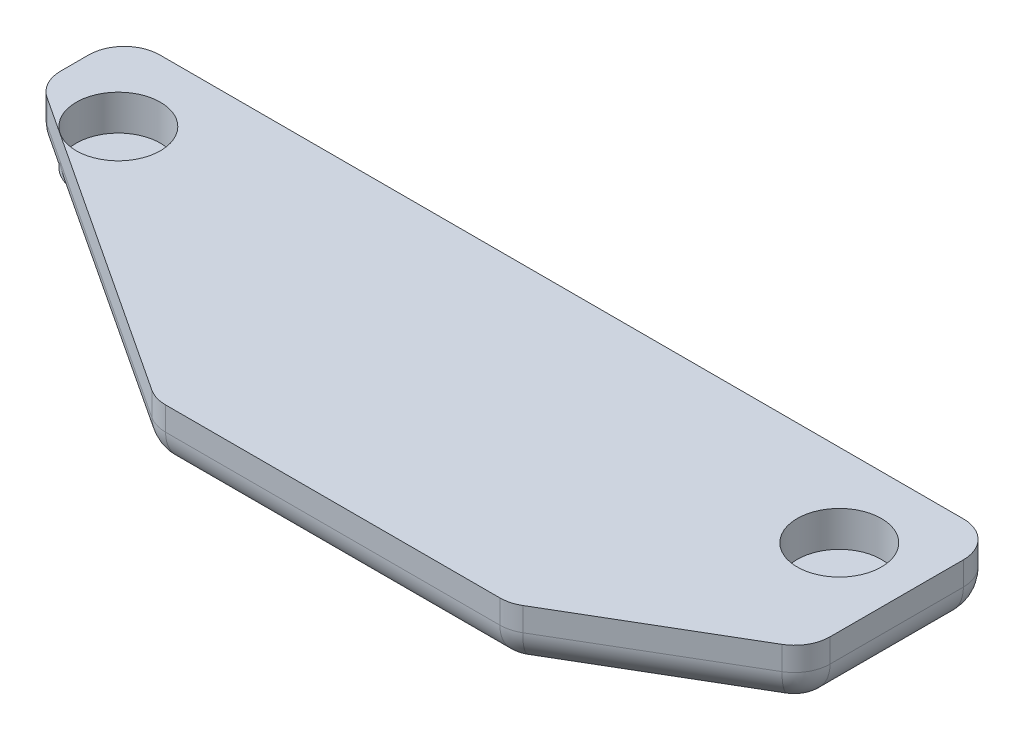
ISO-10303-21;
HEADER;
FILE_DESCRIPTION(('STEP AP214'),'2;1');
FILE_NAME('part.step','',(''),(''),'','','');
FILE_SCHEMA(('AUTOMOTIVE_DESIGN { 1 0 10303 214 1 1 1 1 }'));
ENDSEC;
DATA;
#1=APPLICATION_CONTEXT('core data for automotive mechanical design processes');
#2=APPLICATION_PROTOCOL_DEFINITION('international standard','automotive_design',2000,#1);
#3=PRODUCT_CONTEXT('',#1,'mechanical');
#4=PRODUCT('Part','Part','',(#3));
#5=PRODUCT_RELATED_PRODUCT_CATEGORY('part','',(#4));
#6=PRODUCT_DEFINITION_FORMATION('','',#4);
#7=PRODUCT_DEFINITION_CONTEXT('part definition',#1,'design');
#8=PRODUCT_DEFINITION('design','',#6,#7);
#9=PRODUCT_DEFINITION_SHAPE('','',#8);
#10=(LENGTH_UNIT() NAMED_UNIT(*) SI_UNIT(.MILLI.,.METRE.));
#11=(NAMED_UNIT(*) PLANE_ANGLE_UNIT() SI_UNIT($,.RADIAN.));
#12=(NAMED_UNIT(*) SI_UNIT($,.STERADIAN.) SOLID_ANGLE_UNIT());
#13=UNCERTAINTY_MEASURE_WITH_UNIT(LENGTH_MEASURE(1.E-05),#10,'distance_accuracy_value','');
#14=(GEOMETRIC_REPRESENTATION_CONTEXT(3) GLOBAL_UNCERTAINTY_ASSIGNED_CONTEXT((#13)) GLOBAL_UNIT_ASSIGNED_CONTEXT((#10,
#11,#12)) REPRESENTATION_CONTEXT('',''));
#15=CARTESIAN_POINT('',(0.,0.,0.));
#16=DIRECTION('',(0.,0.,1.));
#17=DIRECTION('',(1.,0.,0.));
#18=AXIS2_PLACEMENT_3D('',#15,#16,#17);
#19=CARTESIAN_POINT('',(-21.2161538362544,2.5,-11.7419034293701));
#20=DIRECTION('',(0.,0.,1.));
#21=DIRECTION('',(1.,0.,0.));
#22=AXIS2_PLACEMENT_3D('',#19,#20,#21);
#23=PLANE('',#22);
#24=DIRECTION('',(-1.,0.,0.));
#25=VECTOR('',#24,1.);
#26=CARTESIAN_POINT('',(-21.2161538362544,2.5,-11.7419034293701));
#27=LINE('',#26,#25);
#28=CARTESIAN_POINT('',(14.2838461637456,2.5,-11.7419034293701));
#29=VERTEX_POINT('',#28);
#30=CARTESIAN_POINT('',(-19.7161538362544,2.5,-11.7419034293701));
#31=VERTEX_POINT('',#30);
#32=EDGE_CURVE('E342',#29,#31,#27,.T.);
#33=ORIENTED_EDGE('',*,*,#32,.F.);
#34=DIRECTION('',(0.,-1.,0.));
#35=VECTOR('',#34,1.);
#36=CARTESIAN_POINT('',(14.2838461637456,2.5,-11.7419034293701));
#37=LINE('',#36,#35);
#38=CARTESIAN_POINT('',(14.2838461637456,1.5,-11.7419034293701));
#39=VERTEX_POINT('',#38);
#40=EDGE_CURVE('E11',#29,#39,#37,.T.);
#41=ORIENTED_EDGE('',*,*,#40,.T.);
#42=DIRECTION('',(-1.,0.,0.));
#43=VECTOR('',#42,1.);
#44=CARTESIAN_POINT('',(-21.2161538362544,1.5,-11.7419034293701));
#45=LINE('',#44,#43);
#46=CARTESIAN_POINT('',(-19.7161538362544,1.5,-11.7419034293701));
#47=VERTEX_POINT('',#46);
#48=EDGE_CURVE('E55',#39,#47,#45,.T.);
#49=ORIENTED_EDGE('',*,*,#48,.T.);
#50=DIRECTION('',(0.,-1.,0.));
#51=VECTOR('',#50,1.);
#52=CARTESIAN_POINT('',(-19.7161538362544,2.5,-11.7419034293701));
#53=LINE('',#52,#51);
#54=EDGE_CURVE('E254',#47,#31,#53,.F.);
#55=ORIENTED_EDGE('',*,*,#54,.T.);
#56=EDGE_LOOP('',(#33,#41,#49,#55));
#57=FACE_BOUND('',#56,.T.);
#58=ADVANCED_FACE('F45',(#57),#23,.F.);
#59=CARTESIAN_POINT('',(-21.2161538362544,2.5,-11.7419034293701));
#60=DIRECTION('',(1.,0.,0.));
#61=DIRECTION('',(0.,0.,-1.));
#62=AXIS2_PLACEMENT_3D('',#59,#60,#61);
#63=PLANE('',#62);
#64=DIRECTION('',(0.,0.,1.));
#65=VECTOR('',#64,1.);
#66=CARTESIAN_POINT('',(-21.2161538362544,1.5,-11.7419034293701));
#67=LINE('',#66,#65);
#68=CARTESIAN_POINT('',(-21.2161538362544,1.5,-10.2419034293701));
#69=VERTEX_POINT('',#68);
#70=CARTESIAN_POINT('',(-21.2161538362544,1.5,-9.05107985148774));
#71=VERTEX_POINT('',#70);
#72=EDGE_CURVE('E220',#69,#71,#67,.T.);
#73=ORIENTED_EDGE('',*,*,#72,.T.);
#74=DIRECTION('',(0.,-1.,0.));
#75=VECTOR('',#74,1.);
#76=CARTESIAN_POINT('',(-21.2161538362544,2.5,-9.05107985148774));
#77=LINE('',#76,#75);
#78=CARTESIAN_POINT('',(-21.2161538362544,2.5,-9.05107985148774));
#79=VERTEX_POINT('',#78);
#80=EDGE_CURVE('E223',#71,#79,#77,.F.);
#81=ORIENTED_EDGE('',*,*,#80,.T.);
#82=DIRECTION('',(0.,0.,1.));
#83=VECTOR('',#82,1.);
#84=CARTESIAN_POINT('',(-21.2161538362544,2.5,-11.7419034293701));
#85=LINE('',#84,#83);
#86=CARTESIAN_POINT('',(-21.2161538362544,2.5,-10.2419034293701));
#87=VERTEX_POINT('',#86);
#88=EDGE_CURVE('E346',#87,#79,#85,.T.);
#89=ORIENTED_EDGE('',*,*,#88,.F.);
#90=DIRECTION('',(0.,-1.,0.));
#91=VECTOR('',#90,1.);
#92=CARTESIAN_POINT('',(-21.2161538362544,2.5,-10.2419034293701));
#93=LINE('',#92,#91);
#94=EDGE_CURVE('E217',#87,#69,#93,.T.);
#95=ORIENTED_EDGE('',*,*,#94,.T.);
#96=EDGE_LOOP('',(#73,#81,#89,#95));
#97=FACE_BOUND('',#96,.T.);
#98=ADVANCED_FACE('F390',(#97),#63,.F.);
#99=CARTESIAN_POINT('',(-21.2161538362544,2.5,-8.24190342937014));
#100=DIRECTION('',(0.549177886660837,0.,-0.835705479701274));
#101=DIRECTION('',(-0.835705479701274,0.,-0.549177886660837));
#102=AXIS2_PLACEMENT_3D('',#99,#100,#101);
#103=PLANE('',#102);
#104=DIRECTION('',(0.835705479701274,0.,0.549177886660837));
#105=VECTOR('',#104,1.);
#106=CARTESIAN_POINT('',(-21.2161538362544,1.5,-8.24190342937014));
#107=LINE('',#106,#105);
#108=CARTESIAN_POINT('',(-20.5399206662457,1.5,-7.79752163193583));
#109=VERTEX_POINT('',#108);
#110=CARTESIAN_POINT('',(-7.59117393693629,1.5,0.711654790181765));
#111=VERTEX_POINT('',#110);
#112=EDGE_CURVE('E211',#109,#111,#107,.T.);
#113=ORIENTED_EDGE('',*,*,#112,.T.);
#114=DIRECTION('',(0.,-1.,0.));
#115=VECTOR('',#114,1.);
#116=CARTESIAN_POINT('',(-7.59117393693629,2.5,0.711654790181766));
#117=LINE('',#116,#115);
#118=CARTESIAN_POINT('',(-7.59117393693629,2.5,0.711654790181766));
#119=VERTEX_POINT('',#118);
#120=EDGE_CURVE('E214',#111,#119,#117,.F.);
#121=ORIENTED_EDGE('',*,*,#120,.T.);
#122=DIRECTION('',(0.835705479701274,0.,0.549177886660837));
#123=VECTOR('',#122,1.);
#124=CARTESIAN_POINT('',(-21.2161538362544,2.5,-8.24190342937014));
#125=LINE('',#124,#123);
#126=CARTESIAN_POINT('',(-20.5399206662457,2.5,-7.79752163193583));
#127=VERTEX_POINT('',#126);
#128=EDGE_CURVE('E351',#127,#119,#125,.T.);
#129=ORIENTED_EDGE('',*,*,#128,.F.);
#130=DIRECTION('',(0.,-1.,0.));
#131=VECTOR('',#130,1.);
#132=CARTESIAN_POINT('',(-20.5399206662457,2.5,-7.79752163193583));
#133=LINE('',#132,#131);
#134=EDGE_CURVE('E163',#127,#109,#133,.T.);
#135=ORIENTED_EDGE('',*,*,#134,.T.);
#136=EDGE_LOOP('',(#113,#121,#129,#135));
#137=FACE_BOUND('',#136,.T.);
#138=ADVANCED_FACE('F395',(#137),#103,.F.);
#139=CARTESIAN_POINT('',(-7.21615383625442,2.5,0.958096570629853));
#140=DIRECTION('',(0.,0.,-1.));
#141=DIRECTION('',(-1.,0.,0.));
#142=AXIS2_PLACEMENT_3D('',#139,#140,#141);
#143=PLANE('',#142);
#144=DIRECTION('',(1.,0.,0.));
#145=VECTOR('',#144,1.);
#146=CARTESIAN_POINT('',(-7.21615383625442,1.5,0.958096570629853));
#147=LINE('',#146,#145);
#148=CARTESIAN_POINT('',(-6.76740710694503,1.5,0.958096570629853));
#149=VERTEX_POINT('',#148);
#150=CARTESIAN_POINT('',(7.37582391861444,1.5,0.958096570629853));
#151=VERTEX_POINT('',#150);
#152=EDGE_CURVE('E180',#149,#151,#147,.T.);
#153=ORIENTED_EDGE('',*,*,#152,.T.);
#154=DIRECTION('',(0.,-1.,0.));
#155=VECTOR('',#154,1.);
#156=CARTESIAN_POINT('',(7.37582391861444,2.5,0.958096570629853));
#157=LINE('',#156,#155);
#158=CARTESIAN_POINT('',(7.37582391861444,2.5,0.958096570629853));
#159=VERTEX_POINT('',#158);
#160=EDGE_CURVE('E192',#151,#159,#157,.F.);
#161=ORIENTED_EDGE('',*,*,#160,.T.);
#162=DIRECTION('',(1.,0.,0.));
#163=VECTOR('',#162,1.);
#164=CARTESIAN_POINT('',(-7.21615383625442,2.5,0.958096570629853));
#165=LINE('',#164,#163);
#166=CARTESIAN_POINT('',(-6.76740710694503,2.5,0.958096570629853));
#167=VERTEX_POINT('',#166);
#168=EDGE_CURVE('E158',#167,#159,#165,.T.);
#169=ORIENTED_EDGE('',*,*,#168,.F.);
#170=DIRECTION('',(0.,-1.,0.));
#171=VECTOR('',#170,1.);
#172=CARTESIAN_POINT('',(-6.76740710694503,2.5,0.958096570629853));
#173=LINE('',#172,#171);
#174=EDGE_CURVE('E185',#167,#149,#173,.T.);
#175=ORIENTED_EDGE('',*,*,#174,.T.);
#176=EDGE_LOOP('',(#153,#161,#169,#175));
#177=FACE_BOUND('',#176,.T.);
#178=ADVANCED_FACE('F491',(#177),#143,.F.);
#179=CARTESIAN_POINT('',(7.78384616374558,2.5,0.958096570629853));
#180=DIRECTION('',(-0.506549048630866,0.,-0.862211146605729));
#181=DIRECTION('',(-0.862211146605729,0.,0.506549048630866));
#182=AXIS2_PLACEMENT_3D('',#179,#180,#181);
#183=PLANE('',#182);
#184=DIRECTION('',(0.862211146605729,0.,-0.506549048630866));
#185=VECTOR('',#184,1.);
#186=CARTESIAN_POINT('',(7.78384616374558,2.5,0.958096570629853));
#187=LINE('',#186,#185);
#188=CARTESIAN_POINT('',(8.13564749156074,2.5,0.751413290538446));
#189=VERTEX_POINT('',#188);
#190=CARTESIAN_POINT('',(15.0436697366919,2.5,-3.3070497784761));
#191=VERTEX_POINT('',#190);
#192=EDGE_CURVE('E155',#189,#191,#187,.T.);
#193=ORIENTED_EDGE('',*,*,#192,.F.);
#194=DIRECTION('',(0.,-1.,0.));
#195=VECTOR('',#194,1.);
#196=CARTESIAN_POINT('',(8.13564749156074,2.5,0.751413290538446));
#197=LINE('',#196,#195);
#198=CARTESIAN_POINT('',(8.13564749156074,1.5,0.751413290538446));
#199=VERTEX_POINT('',#198);
#200=EDGE_CURVE('E169',#189,#199,#197,.T.);
#201=ORIENTED_EDGE('',*,*,#200,.T.);
#202=DIRECTION('',(0.862211146605729,0.,-0.506549048630866));
#203=VECTOR('',#202,1.);
#204=CARTESIAN_POINT('',(7.78384616374558,1.5,0.958096570629853));
#205=LINE('',#204,#203);
#206=CARTESIAN_POINT('',(15.0436697366919,1.5,-3.3070497784761));
#207=VERTEX_POINT('',#206);
#208=EDGE_CURVE('E181',#199,#207,#205,.T.);
#209=ORIENTED_EDGE('',*,*,#208,.T.);
#210=DIRECTION('',(0.,-1.,0.));
#211=VECTOR('',#210,1.);
#212=CARTESIAN_POINT('',(15.0436697366919,2.5,-3.3070497784761));
#213=LINE('',#212,#211);
#214=EDGE_CURVE('E171',#207,#191,#213,.F.);
#215=ORIENTED_EDGE('',*,*,#214,.T.);
#216=EDGE_LOOP('',(#193,#201,#209,#215));
#217=FACE_BOUND('',#216,.T.);
#218=ADVANCED_FACE('F168',(#217),#183,.F.);
#219=CARTESIAN_POINT('',(15.7838461637456,2.5,-3.74190342937014));
#220=DIRECTION('',(-1.,0.,0.));
#221=DIRECTION('',(0.,0.,1.));
#222=AXIS2_PLACEMENT_3D('',#219,#220,#221);
#223=PLANE('',#222);
#224=DIRECTION('',(0.,0.,-1.));
#225=VECTOR('',#224,1.);
#226=CARTESIAN_POINT('',(15.7838461637456,2.5,-3.74190342937014));
#227=LINE('',#226,#225);
#228=CARTESIAN_POINT('',(15.7838461637456,2.5,-4.60036649838469));
#229=VERTEX_POINT('',#228);
#230=CARTESIAN_POINT('',(15.7838461637456,2.5,-10.2419034293701));
#231=VERTEX_POINT('',#230);
#232=EDGE_CURVE('E173',#229,#231,#227,.T.);
#233=ORIENTED_EDGE('',*,*,#232,.F.);
#234=DIRECTION('',(0.,-1.,0.));
#235=VECTOR('',#234,1.);
#236=CARTESIAN_POINT('',(15.7838461637456,2.5,-4.60036649838469));
#237=LINE('',#236,#235);
#238=CARTESIAN_POINT('',(15.7838461637456,1.5,-4.60036649838469));
#239=VERTEX_POINT('',#238);
#240=EDGE_CURVE('E251',#229,#239,#237,.T.);
#241=ORIENTED_EDGE('',*,*,#240,.T.);
#242=DIRECTION('',(0.,0.,-1.));
#243=VECTOR('',#242,1.);
#244=CARTESIAN_POINT('',(15.7838461637456,1.5,-3.74190342937014));
#245=LINE('',#244,#243);
#246=CARTESIAN_POINT('',(15.7838461637456,1.5,-10.2419034293701));
#247=VERTEX_POINT('',#246);
#248=EDGE_CURVE('E248',#239,#247,#245,.T.);
#249=ORIENTED_EDGE('',*,*,#248,.T.);
#250=DIRECTION('',(0.,-1.,0.));
#251=VECTOR('',#250,1.);
#252=CARTESIAN_POINT('',(15.7838461637456,2.5,-10.2419034293701));
#253=LINE('',#252,#251);
#254=EDGE_CURVE('E245',#247,#231,#253,.F.);
#255=ORIENTED_EDGE('',*,*,#254,.T.);
#256=EDGE_LOOP('',(#233,#241,#249,#255));
#257=FACE_BOUND('',#256,.T.);
#258=ADVANCED_FACE('F372',(#257),#223,.F.);
#259=CARTESIAN_POINT('',(0.,2.5,0.));
#260=DIRECTION('',(0.,1.,0.));
#261=DIRECTION('',(0.,0.,1.));
#262=AXIS2_PLACEMENT_3D('',#259,#260,#261);
#263=PLANE('',#262);
#264=CARTESIAN_POINT('',(-17.9661538362544,2.5,-8.24190342937014));
#265=DIRECTION('',(0.,1.,0.));
#266=DIRECTION('',(0.,0.,1.));
#267=AXIS2_PLACEMENT_3D('',#264,#265,#266);
#268=CIRCLE('',#267,1.78);
#269=CARTESIAN_POINT('',(-17.9661538362544,2.5,-6.46190342937014));
#270=VERTEX_POINT('',#269);
#271=EDGE_CURVE('E338',#270,#270,#268,.T.);
#272=ORIENTED_EDGE('',*,*,#271,.F.);
#273=EDGE_LOOP('',(#272));
#274=FACE_BOUND('',#273,.T.);
#275=CARTESIAN_POINT('',(12.5338461637456,2.5,-8.24190342937015));
#276=DIRECTION('',(0.,1.,0.));
#277=DIRECTION('',(0.,0.,-1.));
#278=AXIS2_PLACEMENT_3D('',#275,#276,#277);
#279=CIRCLE('',#278,1.78);
#280=CARTESIAN_POINT('',(12.5338461637456,2.5,-10.0219034293702));
#281=VERTEX_POINT('',#280);
#282=EDGE_CURVE('E332',#281,#281,#279,.T.);
#283=ORIENTED_EDGE('',*,*,#282,.F.);
#284=EDGE_LOOP('',(#283));
#285=FACE_BOUND('',#284,.T.);
#286=ORIENTED_EDGE('',*,*,#168,.T.);
#287=CARTESIAN_POINT('',(7.37582391861444,2.5,-0.541903429370147));
#288=DIRECTION('',(0.,1.,0.));
#289=DIRECTION('',(0.,0.,1.));
#290=AXIS2_PLACEMENT_3D('',#287,#288,#289);
#291=CIRCLE('',#290,1.5);
#292=EDGE_CURVE('E152',#159,#189,#291,.T.);
#293=ORIENTED_EDGE('',*,*,#292,.T.);
#294=ORIENTED_EDGE('',*,*,#192,.T.);
#295=CARTESIAN_POINT('',(14.2838461637456,2.5,-4.60036649838469));
#296=DIRECTION('',(0.,1.,0.));
#297=DIRECTION('',(0.,0.,1.));
#298=AXIS2_PLACEMENT_3D('',#295,#296,#297);
#299=CIRCLE('',#298,1.5);
#300=EDGE_CURVE('E204',#191,#229,#299,.T.);
#301=ORIENTED_EDGE('',*,*,#300,.T.);
#302=ORIENTED_EDGE('',*,*,#232,.T.);
#303=CARTESIAN_POINT('',(14.2838461637456,2.5,-10.2419034293701));
#304=DIRECTION('',(0.,1.,0.));
#305=DIRECTION('',(0.,0.,1.));
#306=AXIS2_PLACEMENT_3D('',#303,#304,#305);
#307=CIRCLE('',#306,1.5);
#308=EDGE_CURVE('E201',#231,#29,#307,.T.);
#309=ORIENTED_EDGE('',*,*,#308,.T.);
#310=ORIENTED_EDGE('',*,*,#32,.T.);
#311=CARTESIAN_POINT('',(-19.7161538362544,2.5,-10.2419034293701));
#312=DIRECTION('',(0.,1.,0.));
#313=DIRECTION('',(0.,0.,1.));
#314=AXIS2_PLACEMENT_3D('',#311,#312,#313);
#315=CIRCLE('',#314,1.5);
#316=EDGE_CURVE('E195',#31,#87,#315,.T.);
#317=ORIENTED_EDGE('',*,*,#316,.T.);
#318=ORIENTED_EDGE('',*,*,#88,.T.);
#319=CARTESIAN_POINT('',(-19.7161538362544,2.5,-9.05107985148774));
#320=DIRECTION('',(0.,1.,0.));
#321=DIRECTION('',(0.,0.,1.));
#322=AXIS2_PLACEMENT_3D('',#319,#320,#321);
#323=CIRCLE('',#322,1.5);
#324=EDGE_CURVE('E198',#79,#127,#323,.T.);
#325=ORIENTED_EDGE('',*,*,#324,.T.);
#326=ORIENTED_EDGE('',*,*,#128,.T.);
#327=CARTESIAN_POINT('',(-6.76740710694503,2.5,-0.541903429370147));
#328=DIRECTION('',(0.,1.,0.));
#329=DIRECTION('',(0.,0.,1.));
#330=AXIS2_PLACEMENT_3D('',#327,#328,#329);
#331=CIRCLE('',#330,1.5);
#332=EDGE_CURVE('E164',#119,#167,#331,.T.);
#333=ORIENTED_EDGE('',*,*,#332,.T.);
#334=EDGE_LOOP('',(#286,#293,#294,#301,#302,#309,#310,#317,#318,#325,#326,#333));
#335=FACE_BOUND('',#334,.T.);
#336=ADVANCED_FACE('F154',(#274,#285,#335),#263,.T.);
#337=CARTESIAN_POINT('',(0.,0.,0.));
#338=DIRECTION('',(0.,1.,0.));
#339=DIRECTION('',(0.,0.,1.));
#340=AXIS2_PLACEMENT_3D('',#337,#338,#339);
#341=PLANE('',#340);
#342=DIRECTION('',(0.835705479701274,0.,0.549177886660837));
#343=VECTOR('',#342,1.);
#344=CARTESIAN_POINT('',(-1.79231818639165,0.,2.72744071842208));
#345=LINE('',#344,#343);
#346=CARTESIAN_POINT('',(-6.76740710694504,0.,-0.541903429370147));
#347=VERTEX_POINT('',#346);
#348=CARTESIAN_POINT('',(-19.7161538362544,0.,-9.05107985148774));
#349=VERTEX_POINT('',#348);
#350=EDGE_CURVE('E238',#347,#349,#345,.F.);
#351=ORIENTED_EDGE('',*,*,#350,.T.);
#352=DIRECTION('',(0.,0.,1.));
#353=VECTOR('',#352,1.);
#354=CARTESIAN_POINT('',(-19.7161538362544,0.,0.));
#355=LINE('',#354,#353);
#356=CARTESIAN_POINT('',(-19.7161538362544,0.,-10.2419034293701));
#357=VERTEX_POINT('',#356);
#358=EDGE_CURVE('E241',#349,#357,#355,.F.);
#359=ORIENTED_EDGE('',*,*,#358,.T.);
#360=DIRECTION('',(-1.,0.,0.));
#361=VECTOR('',#360,1.);
#362=CARTESIAN_POINT('',(0.,0.,-10.2419034293701));
#363=LINE('',#362,#361);
#364=CARTESIAN_POINT('',(14.2838461637456,0.,-10.2419034293701));
#365=VERTEX_POINT('',#364);
#366=EDGE_CURVE('E226',#357,#365,#363,.F.);
#367=ORIENTED_EDGE('',*,*,#366,.T.);
#368=DIRECTION('',(0.,0.,-1.));
#369=VECTOR('',#368,1.);
#370=CARTESIAN_POINT('',(14.2838461637456,0.,0.));
#371=LINE('',#370,#369);
#372=CARTESIAN_POINT('',(14.2838461637456,0.,-4.60036649838469));
#373=VERTEX_POINT('',#372);
#374=EDGE_CURVE('E229',#365,#373,#371,.F.);
#375=ORIENTED_EDGE('',*,*,#374,.T.);
#376=DIRECTION('',(0.862211146605729,0.,-0.506549048630866));
#377=VECTOR('',#376,1.);
#378=CARTESIAN_POINT('',(1.65589942406639,0.,2.81855221117684));
#379=LINE('',#378,#377);
#380=CARTESIAN_POINT('',(7.37582391861444,0.,-0.541903429370147));
#381=VERTEX_POINT('',#380);
#382=EDGE_CURVE('E232',#373,#381,#379,.F.);
#383=ORIENTED_EDGE('',*,*,#382,.T.);
#384=DIRECTION('',(1.,0.,0.));
#385=VECTOR('',#384,1.);
#386=CARTESIAN_POINT('',(0.,0.,-0.541903429370147));
#387=LINE('',#386,#385);
#388=EDGE_CURVE('E235',#381,#347,#387,.F.);
#389=ORIENTED_EDGE('',*,*,#388,.T.);
#390=EDGE_LOOP('',(#351,#359,#367,#375,#383,#389));
#391=FACE_BOUND('',#390,.T.);
#392=ADVANCED_FACE('F371',(#391),#341,.F.);
#393=CARTESIAN_POINT('',(12.5338461637456,1.,-8.24190342937015));
#394=DIRECTION('',(0.,1.,0.));
#395=DIRECTION('',(0.,0.,1.));
#396=AXIS2_PLACEMENT_3D('',#393,#394,#395);
#397=CYLINDRICAL_SURFACE('',#396,1.78);
#398=CARTESIAN_POINT('',(12.5338461637456,1.,-8.24190342937015));
#399=DIRECTION('',(0.,1.,0.));
#400=DIRECTION('',(0.,0.,-1.));
#401=AXIS2_PLACEMENT_3D('',#398,#399,#400);
#402=CIRCLE('',#401,1.78);
#403=CARTESIAN_POINT('',(12.5338461637456,1.,-10.0219034293702));
#404=VERTEX_POINT('',#403);
#405=EDGE_CURVE('E326',#404,#404,#402,.T.);
#406=ORIENTED_EDGE('',*,*,#405,.F.);
#407=EDGE_LOOP('',(#406));
#408=FACE_BOUND('',#407,.T.);
#409=ORIENTED_EDGE('',*,*,#282,.T.);
#410=EDGE_LOOP('',(#409));
#411=FACE_BOUND('',#410,.T.);
#412=ADVANCED_FACE('F376',(#408,#411),#397,.F.);
#413=CARTESIAN_POINT('',(12.5338461637456,1.,-8.24190342937015));
#414=DIRECTION('',(0.,-1.,0.));
#415=DIRECTION('',(0.,0.,-1.));
#416=AXIS2_PLACEMENT_3D('',#413,#414,#415);
#417=PLANE('',#416);
#418=ORIENTED_EDGE('',*,*,#405,.T.);
#419=EDGE_LOOP('',(#418));
#420=FACE_BOUND('',#419,.T.);
#421=ADVANCED_FACE('F378',(#420),#417,.F.);
#422=CARTESIAN_POINT('',(-17.9661538362544,1.,-8.24190342937014));
#423=DIRECTION('',(0.,1.,0.));
#424=DIRECTION('',(0.,0.,1.));
#425=AXIS2_PLACEMENT_3D('',#422,#423,#424);
#426=CYLINDRICAL_SURFACE('',#425,1.78);
#427=CARTESIAN_POINT('',(-17.9661538362544,1.,-8.24190342937014));
#428=DIRECTION('',(0.,1.,0.));
#429=DIRECTION('',(0.,0.,1.));
#430=AXIS2_PLACEMENT_3D('',#427,#428,#429);
#431=CIRCLE('',#430,1.78);
#432=CARTESIAN_POINT('',(-17.9661538362544,1.,-6.46190342937014));
#433=VERTEX_POINT('',#432);
#434=EDGE_CURVE('E347',#433,#433,#431,.T.);
#435=ORIENTED_EDGE('',*,*,#434,.F.);
#436=EDGE_LOOP('',(#435));
#437=FACE_BOUND('',#436,.T.);
#438=ORIENTED_EDGE('',*,*,#271,.T.);
#439=EDGE_LOOP('',(#438));
#440=FACE_BOUND('',#439,.T.);
#441=ADVANCED_FACE('F367',(#437,#440),#426,.F.);
#442=CARTESIAN_POINT('',(-17.9661538362544,1.,-8.24190342937014));
#443=DIRECTION('',(0.,1.,0.));
#444=DIRECTION('',(0.,0.,1.));
#445=AXIS2_PLACEMENT_3D('',#442,#443,#444);
#446=PLANE('',#445);
#447=ORIENTED_EDGE('',*,*,#434,.T.);
#448=EDGE_LOOP('',(#447));
#449=FACE_BOUND('',#448,.T.);
#450=ADVANCED_FACE('F465',(#449),#446,.T.);
#451=CARTESIAN_POINT('',(-19.7161538362544,2.5,-10.2419034293701));
#452=DIRECTION('',(0.,-1.,0.));
#453=DIRECTION('',(0.,0.,-1.));
#454=AXIS2_PLACEMENT_3D('',#451,#452,#453);
#455=CYLINDRICAL_SURFACE('',#454,1.5);
#456=CARTESIAN_POINT('',(-19.7161538362544,1.5,-10.2419034293701));
#457=DIRECTION('',(0.,-1.,0.));
#458=DIRECTION('',(0.,0.,-1.));
#459=AXIS2_PLACEMENT_3D('',#456,#457,#458);
#460=CIRCLE('',#459,1.5);
#461=EDGE_CURVE('E49',#69,#47,#460,.T.);
#462=ORIENTED_EDGE('',*,*,#461,.F.);
#463=ORIENTED_EDGE('',*,*,#94,.F.);
#464=ORIENTED_EDGE('',*,*,#316,.F.);
#465=ORIENTED_EDGE('',*,*,#54,.F.);
#466=EDGE_LOOP('',(#462,#463,#464,#465));
#467=FACE_BOUND('',#466,.T.);
#468=ADVANCED_FACE('F47',(#467),#455,.T.);
#469=CARTESIAN_POINT('',(-19.7161538362544,1.5,-10.2419034293701));
#470=DIRECTION('',(0.,0.,-1.));
#471=DIRECTION('',(-1.,0.,0.));
#472=AXIS2_PLACEMENT_3D('',#469,#470,#471);
#473=SPHERICAL_SURFACE('',#472,1.5);
#474=CARTESIAN_POINT('',(-19.7161538362544,1.5,-10.2419034293701));
#475=DIRECTION('',(0.,0.,-1.));
#476=DIRECTION('',(-1.,0.,0.));
#477=AXIS2_PLACEMENT_3D('',#474,#475,#476);
#478=CIRCLE('',#477,1.5);
#479=EDGE_CURVE('E316',#69,#357,#478,.F.);
#480=ORIENTED_EDGE('',*,*,#479,.F.);
#481=ORIENTED_EDGE('',*,*,#461,.T.);
#482=CARTESIAN_POINT('',(-19.7161538362544,1.5,-10.2419034293701));
#483=DIRECTION('',(-1.,0.,0.));
#484=DIRECTION('',(0.,0.,1.));
#485=AXIS2_PLACEMENT_3D('',#482,#483,#484);
#486=CIRCLE('',#485,1.5);
#487=EDGE_CURVE('E319',#357,#47,#486,.F.);
#488=ORIENTED_EDGE('',*,*,#487,.F.);
#489=EDGE_LOOP('',(#480,#481,#488));
#490=FACE_BOUND('',#489,.T.);
#491=ADVANCED_FACE('F459',(#490),#473,.T.);
#492=CARTESIAN_POINT('',(14.2838461637456,2.5,-10.2419034293701));
#493=DIRECTION('',(0.,-1.,0.));
#494=DIRECTION('',(0.,0.,-1.));
#495=AXIS2_PLACEMENT_3D('',#492,#493,#494);
#496=CYLINDRICAL_SURFACE('',#495,1.5);
#497=ORIENTED_EDGE('',*,*,#308,.F.);
#498=ORIENTED_EDGE('',*,*,#254,.F.);
#499=CARTESIAN_POINT('',(14.2838461637456,1.5,-10.2419034293701));
#500=DIRECTION('',(0.,-1.,0.));
#501=DIRECTION('',(0.,0.,-1.));
#502=AXIS2_PLACEMENT_3D('',#499,#500,#501);
#503=CIRCLE('',#502,1.5);
#504=EDGE_CURVE('E312',#39,#247,#503,.T.);
#505=ORIENTED_EDGE('',*,*,#504,.F.);
#506=ORIENTED_EDGE('',*,*,#40,.F.);
#507=EDGE_LOOP('',(#497,#498,#505,#506));
#508=FACE_BOUND('',#507,.T.);
#509=ADVANCED_FACE('F457',(#508),#496,.T.);
#510=CARTESIAN_POINT('',(-21.2161538362544,1.5,-10.2419034293701));
#511=DIRECTION('',(-1.,0.,0.));
#512=DIRECTION('',(0.,0.,1.));
#513=AXIS2_PLACEMENT_3D('',#510,#511,#512);
#514=CYLINDRICAL_SURFACE('',#513,1.5);
#515=ORIENTED_EDGE('',*,*,#487,.T.);
#516=ORIENTED_EDGE('',*,*,#48,.F.);
#517=CARTESIAN_POINT('',(14.2838461637456,1.5,-10.2419034293701));
#518=DIRECTION('',(1.,0.,0.));
#519=DIRECTION('',(0.,0.,-1.));
#520=AXIS2_PLACEMENT_3D('',#517,#518,#519);
#521=CIRCLE('',#520,1.5);
#522=EDGE_CURVE('E308',#365,#39,#521,.T.);
#523=ORIENTED_EDGE('',*,*,#522,.F.);
#524=ORIENTED_EDGE('',*,*,#366,.F.);
#525=EDGE_LOOP('',(#515,#516,#523,#524));
#526=FACE_BOUND('',#525,.T.);
#527=ADVANCED_FACE('F453',(#526),#514,.T.);
#528=CARTESIAN_POINT('',(-19.7161538362544,1.5,-11.7419034293701));
#529=DIRECTION('',(0.,0.,1.));
#530=DIRECTION('',(1.,0.,0.));
#531=AXIS2_PLACEMENT_3D('',#528,#529,#530);
#532=CYLINDRICAL_SURFACE('',#531,1.5);
#533=ORIENTED_EDGE('',*,*,#479,.T.);
#534=ORIENTED_EDGE('',*,*,#358,.F.);
#535=CARTESIAN_POINT('',(-19.7161538362544,1.5,-9.05107985148774));
#536=DIRECTION('',(0.,0.,1.));
#537=DIRECTION('',(1.,0.,0.));
#538=AXIS2_PLACEMENT_3D('',#535,#536,#537);
#539=CIRCLE('',#538,1.5);
#540=EDGE_CURVE('E304',#71,#349,#539,.T.);
#541=ORIENTED_EDGE('',*,*,#540,.F.);
#542=ORIENTED_EDGE('',*,*,#72,.F.);
#543=EDGE_LOOP('',(#533,#534,#541,#542));
#544=FACE_BOUND('',#543,.T.);
#545=ADVANCED_FACE('F449',(#544),#532,.T.);
#546=CARTESIAN_POINT('',(-19.7161538362544,2.5,-9.05107985148774));
#547=DIRECTION('',(0.,-1.,0.));
#548=DIRECTION('',(0.,0.,-1.));
#549=AXIS2_PLACEMENT_3D('',#546,#547,#548);
#550=CYLINDRICAL_SURFACE('',#549,1.5);
#551=ORIENTED_EDGE('',*,*,#324,.F.);
#552=ORIENTED_EDGE('',*,*,#80,.F.);
#553=CARTESIAN_POINT('',(-19.7161538362544,1.5,-9.05107985148774));
#554=DIRECTION('',(0.,-1.,0.));
#555=DIRECTION('',(0.,0.,-1.));
#556=AXIS2_PLACEMENT_3D('',#553,#554,#555);
#557=CIRCLE('',#556,1.5);
#558=EDGE_CURVE('E300',#109,#71,#557,.T.);
#559=ORIENTED_EDGE('',*,*,#558,.F.);
#560=ORIENTED_EDGE('',*,*,#134,.F.);
#561=EDGE_LOOP('',(#551,#552,#559,#560));
#562=FACE_BOUND('',#561,.T.);
#563=ADVANCED_FACE('F445',(#562),#550,.T.);
#564=CARTESIAN_POINT('',(14.2838461637456,1.5,-10.2419034293701));
#565=DIRECTION('',(0.,0.,-1.));
#566=DIRECTION('',(-1.,0.,0.));
#567=AXIS2_PLACEMENT_3D('',#564,#565,#566);
#568=SPHERICAL_SURFACE('',#567,1.5);
#569=ORIENTED_EDGE('',*,*,#522,.T.);
#570=ORIENTED_EDGE('',*,*,#504,.T.);
#571=CARTESIAN_POINT('',(14.2838461637456,1.5,-10.2419034293701));
#572=DIRECTION('',(0.,0.,-1.));
#573=DIRECTION('',(-1.,0.,0.));
#574=AXIS2_PLACEMENT_3D('',#571,#572,#573);
#575=CIRCLE('',#574,1.5);
#576=EDGE_CURVE('E296',#365,#247,#575,.F.);
#577=ORIENTED_EDGE('',*,*,#576,.F.);
#578=EDGE_LOOP('',(#569,#570,#577));
#579=FACE_BOUND('',#578,.T.);
#580=ADVANCED_FACE('F441',(#579),#568,.T.);
#581=CARTESIAN_POINT('',(-19.7161538362544,1.5,-9.05107985148774));
#582=DIRECTION('',(0.,-1.,0.));
#583=DIRECTION('',(0.,0.,-1.));
#584=AXIS2_PLACEMENT_3D('',#581,#582,#583);
#585=SPHERICAL_SURFACE('',#584,1.5);
#586=ORIENTED_EDGE('',*,*,#558,.T.);
#587=ORIENTED_EDGE('',*,*,#540,.T.);
#588=CARTESIAN_POINT('',(-19.7161538362544,1.5,-9.05107985148774));
#589=DIRECTION('',(-0.835705479701274,0.,-0.549177886660837));
#590=DIRECTION('',(-0.549177886660837,0.,0.835705479701274));
#591=AXIS2_PLACEMENT_3D('',#588,#589,#590);
#592=CIRCLE('',#591,1.5);
#593=EDGE_CURVE('E292',#109,#349,#592,.F.);
#594=ORIENTED_EDGE('',*,*,#593,.F.);
#595=EDGE_LOOP('',(#586,#587,#594));
#596=FACE_BOUND('',#595,.T.);
#597=ADVANCED_FACE('F437',(#596),#585,.T.);
#598=CARTESIAN_POINT('',(14.2838461637456,2.5,-4.60036649838469));
#599=DIRECTION('',(0.,-1.,0.));
#600=DIRECTION('',(0.,0.,-1.));
#601=AXIS2_PLACEMENT_3D('',#598,#599,#600);
#602=CYLINDRICAL_SURFACE('',#601,1.5);
#603=ORIENTED_EDGE('',*,*,#300,.F.);
#604=ORIENTED_EDGE('',*,*,#214,.F.);
#605=CARTESIAN_POINT('',(14.2838461637456,1.5,-4.60036649838469));
#606=DIRECTION('',(0.,-1.,0.));
#607=DIRECTION('',(0.,0.,-1.));
#608=AXIS2_PLACEMENT_3D('',#605,#606,#607);
#609=CIRCLE('',#608,1.5);
#610=EDGE_CURVE('E288',#239,#207,#609,.T.);
#611=ORIENTED_EDGE('',*,*,#610,.F.);
#612=ORIENTED_EDGE('',*,*,#240,.F.);
#613=EDGE_LOOP('',(#603,#604,#611,#612));
#614=FACE_BOUND('',#613,.T.);
#615=ADVANCED_FACE('F433',(#614),#602,.T.);
#616=CARTESIAN_POINT('',(14.2838461637456,1.5,-3.74190342937014));
#617=DIRECTION('',(0.,0.,-1.));
#618=DIRECTION('',(-1.,0.,0.));
#619=AXIS2_PLACEMENT_3D('',#616,#617,#618);
#620=CYLINDRICAL_SURFACE('',#619,1.5);
#621=ORIENTED_EDGE('',*,*,#576,.T.);
#622=ORIENTED_EDGE('',*,*,#248,.F.);
#623=CARTESIAN_POINT('',(14.2838461637456,1.5,-4.60036649838469));
#624=DIRECTION('',(0.,0.,1.));
#625=DIRECTION('',(1.,0.,0.));
#626=AXIS2_PLACEMENT_3D('',#623,#624,#625);
#627=CIRCLE('',#626,1.5);
#628=EDGE_CURVE('E284',#373,#239,#627,.T.);
#629=ORIENTED_EDGE('',*,*,#628,.F.);
#630=ORIENTED_EDGE('',*,*,#374,.F.);
#631=EDGE_LOOP('',(#621,#622,#629,#630));
#632=FACE_BOUND('',#631,.T.);
#633=ADVANCED_FACE('F429',(#632),#620,.T.);
#634=CARTESIAN_POINT('',(-20.3923870062632,1.5,-9.49546164892205));
#635=DIRECTION('',(0.835705479701274,0.,0.549177886660837));
#636=DIRECTION('',(0.549177886660837,0.,-0.835705479701274));
#637=AXIS2_PLACEMENT_3D('',#634,#635,#636);
#638=CYLINDRICAL_SURFACE('',#637,1.5);
#639=ORIENTED_EDGE('',*,*,#593,.T.);
#640=ORIENTED_EDGE('',*,*,#350,.F.);
#641=CARTESIAN_POINT('',(-6.76740710694503,1.5,-0.541903429370146));
#642=DIRECTION('',(0.835705479701274,0.,0.549177886660837));
#643=DIRECTION('',(0.549177886660837,0.,-0.835705479701274));
#644=AXIS2_PLACEMENT_3D('',#641,#642,#643);
#645=CIRCLE('',#644,1.5);
#646=EDGE_CURVE('E280',#111,#347,#645,.T.);
#647=ORIENTED_EDGE('',*,*,#646,.F.);
#648=ORIENTED_EDGE('',*,*,#112,.F.);
#649=EDGE_LOOP('',(#639,#640,#647,#648));
#650=FACE_BOUND('',#649,.T.);
#651=ADVANCED_FACE('F425',(#650),#638,.T.);
#652=CARTESIAN_POINT('',(-6.76740710694503,2.5,-0.541903429370147));
#653=DIRECTION('',(0.,-1.,0.));
#654=DIRECTION('',(0.,0.,-1.));
#655=AXIS2_PLACEMENT_3D('',#652,#653,#654);
#656=CYLINDRICAL_SURFACE('',#655,1.5);
#657=ORIENTED_EDGE('',*,*,#332,.F.);
#658=ORIENTED_EDGE('',*,*,#120,.F.);
#659=CARTESIAN_POINT('',(-6.76740710694503,1.5,-0.541903429370147));
#660=DIRECTION('',(0.,-1.,0.));
#661=DIRECTION('',(0.,0.,-1.));
#662=AXIS2_PLACEMENT_3D('',#659,#660,#661);
#663=CIRCLE('',#662,1.5);
#664=EDGE_CURVE('E276',#149,#111,#663,.T.);
#665=ORIENTED_EDGE('',*,*,#664,.F.);
#666=ORIENTED_EDGE('',*,*,#174,.F.);
#667=EDGE_LOOP('',(#657,#658,#665,#666));
#668=FACE_BOUND('',#667,.T.);
#669=ADVANCED_FACE('F421',(#668),#656,.T.);
#670=CARTESIAN_POINT('',(14.2838461637456,1.5,-4.60036649838469));
#671=DIRECTION('',(0.,-1.,0.));
#672=DIRECTION('',(0.,0.,-1.));
#673=AXIS2_PLACEMENT_3D('',#670,#671,#672);
#674=SPHERICAL_SURFACE('',#673,1.5);
#675=ORIENTED_EDGE('',*,*,#628,.T.);
#676=ORIENTED_EDGE('',*,*,#610,.T.);
#677=CARTESIAN_POINT('',(14.2838461637456,1.5,-4.60036649838469));
#678=DIRECTION('',(0.862211146605729,0.,-0.506549048630865));
#679=DIRECTION('',(-0.506549048630865,0.,-0.862211146605729));
#680=AXIS2_PLACEMENT_3D('',#677,#678,#679);
#681=CIRCLE('',#680,1.5);
#682=EDGE_CURVE('E272',#373,#207,#681,.F.);
#683=ORIENTED_EDGE('',*,*,#682,.F.);
#684=EDGE_LOOP('',(#675,#676,#683));
#685=FACE_BOUND('',#684,.T.);
#686=ADVANCED_FACE('F417',(#685),#674,.T.);
#687=CARTESIAN_POINT('',(-6.76740710694503,1.5,-0.541903429370147));
#688=DIRECTION('',(0.,-1.,0.));
#689=DIRECTION('',(1.,0.,0.));
#690=AXIS2_PLACEMENT_3D('',#687,#688,#689);
#691=SPHERICAL_SURFACE('',#690,1.5);
#692=ORIENTED_EDGE('',*,*,#664,.T.);
#693=ORIENTED_EDGE('',*,*,#646,.T.);
#694=CARTESIAN_POINT('',(-6.76740710694504,1.5,-0.541903429370147));
#695=DIRECTION('',(-1.,0.,0.));
#696=DIRECTION('',(0.,0.,1.));
#697=AXIS2_PLACEMENT_3D('',#694,#695,#696);
#698=CIRCLE('',#697,1.5);
#699=EDGE_CURVE('E268',#149,#347,#698,.F.);
#700=ORIENTED_EDGE('',*,*,#699,.F.);
#701=EDGE_LOOP('',(#692,#693,#700));
#702=FACE_BOUND('',#701,.T.);
#703=ADVANCED_FACE('F413',(#702),#691,.T.);
#704=CARTESIAN_POINT('',(7.02402259079928,1.5,-0.33522014927874));
#705=DIRECTION('',(0.862211146605729,0.,-0.506549048630866));
#706=DIRECTION('',(-0.506549048630866,0.,-0.862211146605729));
#707=AXIS2_PLACEMENT_3D('',#704,#705,#706);
#708=CYLINDRICAL_SURFACE('',#707,1.5);
#709=ORIENTED_EDGE('',*,*,#682,.T.);
#710=ORIENTED_EDGE('',*,*,#208,.F.);
#711=CARTESIAN_POINT('',(7.37582391861444,1.5,-0.541903429370147));
#712=DIRECTION('',(-0.862211146605728,0.,0.506549048630866));
#713=DIRECTION('',(0.506549048630866,0.,0.862211146605728));
#714=AXIS2_PLACEMENT_3D('',#711,#712,#713);
#715=CIRCLE('',#714,1.5);
#716=EDGE_CURVE('E265',#381,#199,#715,.T.);
#717=ORIENTED_EDGE('',*,*,#716,.F.);
#718=ORIENTED_EDGE('',*,*,#382,.F.);
#719=EDGE_LOOP('',(#709,#710,#717,#718));
#720=FACE_BOUND('',#719,.T.);
#721=ADVANCED_FACE('F409',(#720),#708,.T.);
#722=CARTESIAN_POINT('',(-7.21615383625442,1.5,-0.541903429370147));
#723=DIRECTION('',(1.,0.,0.));
#724=DIRECTION('',(0.,0.,-1.));
#725=AXIS2_PLACEMENT_3D('',#722,#723,#724);
#726=CYLINDRICAL_SURFACE('',#725,1.5);
#727=ORIENTED_EDGE('',*,*,#699,.T.);
#728=ORIENTED_EDGE('',*,*,#388,.F.);
#729=CARTESIAN_POINT('',(7.37582391861444,1.5,-0.541903429370147));
#730=DIRECTION('',(1.,0.,0.));
#731=DIRECTION('',(0.,0.,-1.));
#732=AXIS2_PLACEMENT_3D('',#729,#730,#731);
#733=CIRCLE('',#732,1.5);
#734=EDGE_CURVE('E261',#151,#381,#733,.T.);
#735=ORIENTED_EDGE('',*,*,#734,.F.);
#736=ORIENTED_EDGE('',*,*,#152,.F.);
#737=EDGE_LOOP('',(#727,#728,#735,#736));
#738=FACE_BOUND('',#737,.T.);
#739=ADVANCED_FACE('F405',(#738),#726,.T.);
#740=CARTESIAN_POINT('',(7.37582391861444,1.5,-0.541903429370147));
#741=DIRECTION('',(0.,-1.,0.));
#742=DIRECTION('',(0.,0.,-1.));
#743=AXIS2_PLACEMENT_3D('',#740,#741,#742);
#744=SPHERICAL_SURFACE('',#743,1.5);
#745=ORIENTED_EDGE('',*,*,#734,.T.);
#746=ORIENTED_EDGE('',*,*,#716,.T.);
#747=CARTESIAN_POINT('',(7.37582391861444,1.5,-0.541903429370147));
#748=DIRECTION('',(0.,-1.,0.));
#749=DIRECTION('',(0.,0.,-1.));
#750=AXIS2_PLACEMENT_3D('',#747,#748,#749);
#751=CIRCLE('',#750,1.5);
#752=EDGE_CURVE('E177',#151,#199,#751,.F.);
#753=ORIENTED_EDGE('',*,*,#752,.F.);
#754=EDGE_LOOP('',(#745,#746,#753));
#755=FACE_BOUND('',#754,.T.);
#756=ADVANCED_FACE('F402',(#755),#744,.T.);
#757=CARTESIAN_POINT('',(7.37582391861444,2.5,-0.541903429370147));
#758=DIRECTION('',(0.,-1.,0.));
#759=DIRECTION('',(0.,0.,-1.));
#760=AXIS2_PLACEMENT_3D('',#757,#758,#759);
#761=CYLINDRICAL_SURFACE('',#760,1.5);
#762=ORIENTED_EDGE('',*,*,#292,.F.);
#763=ORIENTED_EDGE('',*,*,#160,.F.);
#764=ORIENTED_EDGE('',*,*,#752,.T.);
#765=ORIENTED_EDGE('',*,*,#200,.F.);
#766=EDGE_LOOP('',(#762,#763,#764,#765));
#767=FACE_BOUND('',#766,.T.);
#768=ADVANCED_FACE('F175',(#767),#761,.T.);
#769=CLOSED_SHELL('',(#58,#98,#138,#178,#218,#258,#336,#392,#412,#421,#441,#450,#468,#491,#509,
#527,#545,#563,#580,#597,#615,#633,#651,#669,#686,#703,#721,#739,#756,#768));
#770=MANIFOLD_SOLID_BREP('B2',#769);
#771=ADVANCED_BREP_SHAPE_REPRESENTATION('',(#18,#770),#14);
#772=SHAPE_DEFINITION_REPRESENTATION(#9,#771);
ENDSEC;
END-ISO-10303-21;
